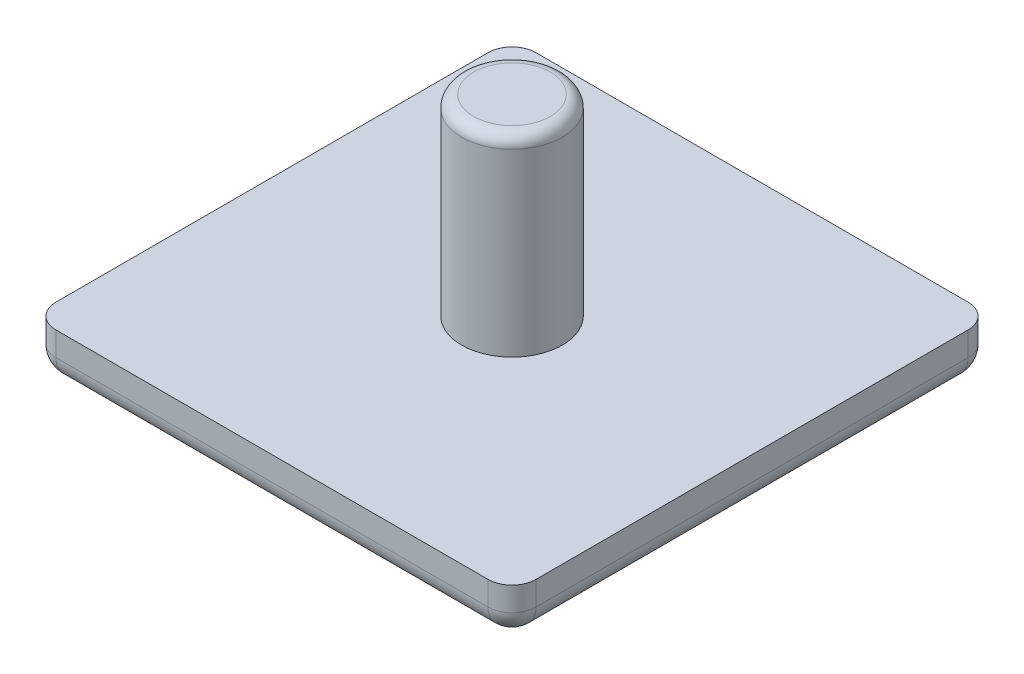
ISO-10303-21;
HEADER;
FILE_DESCRIPTION(('STEP AP214'),'2;1');
FILE_NAME('part.step','',(''),(''),'','','');
FILE_SCHEMA(('AUTOMOTIVE_DESIGN { 1 0 10303 214 1 1 1 1 }'));
ENDSEC;
DATA;
#1=APPLICATION_CONTEXT('core data for automotive mechanical design processes');
#2=APPLICATION_PROTOCOL_DEFINITION('international standard','automotive_design',2000,#1);
#3=PRODUCT_CONTEXT('',#1,'mechanical');
#4=PRODUCT('Part','Part','',(#3));
#5=PRODUCT_RELATED_PRODUCT_CATEGORY('part','',(#4));
#6=PRODUCT_DEFINITION_FORMATION('','',#4);
#7=PRODUCT_DEFINITION_CONTEXT('part definition',#1,'design');
#8=PRODUCT_DEFINITION('design','',#6,#7);
#9=PRODUCT_DEFINITION_SHAPE('','',#8);
#10=(LENGTH_UNIT() NAMED_UNIT(*) SI_UNIT(.MILLI.,.METRE.));
#11=(NAMED_UNIT(*) PLANE_ANGLE_UNIT() SI_UNIT($,.RADIAN.));
#12=(NAMED_UNIT(*) SI_UNIT($,.STERADIAN.) SOLID_ANGLE_UNIT());
#13=UNCERTAINTY_MEASURE_WITH_UNIT(LENGTH_MEASURE(1.E-05),#10,'distance_accuracy_value','');
#14=(GEOMETRIC_REPRESENTATION_CONTEXT(3) GLOBAL_UNCERTAINTY_ASSIGNED_CONTEXT((#13)) GLOBAL_UNIT_ASSIGNED_CONTEXT((#10,
#11,#12)) REPRESENTATION_CONTEXT('',''));
#15=CARTESIAN_POINT('',(0.,0.,0.));
#16=DIRECTION('',(0.,0.,1.));
#17=DIRECTION('',(1.,0.,0.));
#18=AXIS2_PLACEMENT_3D('',#15,#16,#17);
#19=CARTESIAN_POINT('',(10.,8.,-10.));
#20=DIRECTION('',(0.,-1.,0.));
#21=DIRECTION('',(0.,0.,-1.));
#22=AXIS2_PLACEMENT_3D('',#19,#20,#21);
#23=CYLINDRICAL_SURFACE('',#22,2.1);
#24=CARTESIAN_POINT('',(10.,7.5,-10.));
#25=DIRECTION('',(0.,1.,0.));
#26=DIRECTION('',(0.,0.,1.));
#27=AXIS2_PLACEMENT_3D('',#24,#25,#26);
#28=CIRCLE('',#27,2.1);
#29=CARTESIAN_POINT('',(10.,7.5,-7.9));
#30=VERTEX_POINT('',#29);
#31=EDGE_CURVE('E180',#30,#30,#28,.F.);
#32=ORIENTED_EDGE('',*,*,#31,.T.);
#33=EDGE_LOOP('',(#32));
#34=FACE_BOUND('',#33,.T.);
#35=CARTESIAN_POINT('',(10.,0.,-10.));
#36=DIRECTION('',(0.,1.,0.));
#37=DIRECTION('',(0.,0.,1.));
#38=AXIS2_PLACEMENT_3D('',#35,#36,#37);
#39=CIRCLE('',#38,2.1);
#40=CARTESIAN_POINT('',(10.,0.,-7.9));
#41=VERTEX_POINT('',#40);
#42=EDGE_CURVE('E159',#41,#41,#39,.T.);
#43=ORIENTED_EDGE('',*,*,#42,.T.);
#44=EDGE_LOOP('',(#43));
#45=FACE_BOUND('',#44,.T.);
#46=ADVANCED_FACE('F45',(#34,#45),#23,.T.);
#47=CARTESIAN_POINT('',(10.,8.,-10.));
#48=DIRECTION('',(0.,1.,0.));
#49=DIRECTION('',(0.,0.,1.));
#50=AXIS2_PLACEMENT_3D('',#47,#48,#49);
#51=PLANE('',#50);
#52=CARTESIAN_POINT('',(10.,8.,-10.));
#53=DIRECTION('',(0.,1.,0.));
#54=DIRECTION('',(0.,0.,1.));
#55=AXIS2_PLACEMENT_3D('',#52,#53,#54);
#56=CIRCLE('',#55,1.6);
#57=CARTESIAN_POINT('',(10.,8.,-8.4));
#58=VERTEX_POINT('',#57);
#59=EDGE_CURVE('E177',#58,#58,#56,.T.);
#60=ORIENTED_EDGE('',*,*,#59,.T.);
#61=EDGE_LOOP('',(#60));
#62=FACE_BOUND('',#61,.T.);
#63=ADVANCED_FACE('F277',(#62),#51,.T.);
#64=CARTESIAN_POINT('',(0.,-2.,0.));
#65=DIRECTION('',(1.,0.,0.));
#66=DIRECTION('',(0.,0.,-1.));
#67=AXIS2_PLACEMENT_3D('',#64,#65,#66);
#68=PLANE('',#67);
#69=DIRECTION('',(0.,0.,-1.));
#70=VECTOR('',#69,1.);
#71=CARTESIAN_POINT('',(0.,-1.,0.));
#72=LINE('',#71,#70);
#73=CARTESIAN_POINT('',(0.,-1.,-19.));
#74=VERTEX_POINT('',#73);
#75=CARTESIAN_POINT('',(0.,-1.,-1.));
#76=VERTEX_POINT('',#75);
#77=EDGE_CURVE('E175',#74,#76,#72,.F.);
#78=ORIENTED_EDGE('',*,*,#77,.T.);
#79=DIRECTION('',(0.,1.,0.));
#80=VECTOR('',#79,1.);
#81=CARTESIAN_POINT('',(0.,-2.,-1.));
#82=LINE('',#81,#80);
#83=CARTESIAN_POINT('',(0.,0.,-1.));
#84=VERTEX_POINT('',#83);
#85=EDGE_CURVE('E195',#76,#84,#82,.T.);
#86=ORIENTED_EDGE('',*,*,#85,.T.);
#87=DIRECTION('',(0.,0.,-1.));
#88=VECTOR('',#87,1.);
#89=CARTESIAN_POINT('',(0.,0.,0.));
#90=LINE('',#89,#88);
#91=CARTESIAN_POINT('',(0.,0.,-19.));
#92=VERTEX_POINT('',#91);
#93=EDGE_CURVE('E213',#84,#92,#90,.T.);
#94=ORIENTED_EDGE('',*,*,#93,.T.);
#95=DIRECTION('',(0.,1.,0.));
#96=VECTOR('',#95,1.);
#97=CARTESIAN_POINT('',(0.,-2.,-19.));
#98=LINE('',#97,#96);
#99=EDGE_CURVE('E193',#92,#74,#98,.F.);
#100=ORIENTED_EDGE('',*,*,#99,.T.);
#101=EDGE_LOOP('',(#78,#86,#94,#100));
#102=FACE_BOUND('',#101,.T.);
#103=ADVANCED_FACE('F243',(#102),#68,.F.);
#104=CARTESIAN_POINT('',(0.,-2.,-20.));
#105=DIRECTION('',(0.,0.,1.));
#106=DIRECTION('',(1.,0.,0.));
#107=AXIS2_PLACEMENT_3D('',#104,#105,#106);
#108=PLANE('',#107);
#109=DIRECTION('',(1.,0.,0.));
#110=VECTOR('',#109,1.);
#111=CARTESIAN_POINT('',(0.,-1.,-20.));
#112=LINE('',#111,#110);
#113=CARTESIAN_POINT('',(19.,-1.,-20.));
#114=VERTEX_POINT('',#113);
#115=CARTESIAN_POINT('',(1.,-1.,-20.));
#116=VERTEX_POINT('',#115);
#117=EDGE_CURVE('E173',#114,#116,#112,.F.);
#118=ORIENTED_EDGE('',*,*,#117,.T.);
#119=DIRECTION('',(0.,1.,0.));
#120=VECTOR('',#119,1.);
#121=CARTESIAN_POINT('',(1.,-2.,-20.));
#122=LINE('',#121,#120);
#123=CARTESIAN_POINT('',(1.,0.,-20.));
#124=VERTEX_POINT('',#123);
#125=EDGE_CURVE('E69',#116,#124,#122,.T.);
#126=ORIENTED_EDGE('',*,*,#125,.T.);
#127=DIRECTION('',(1.,0.,0.));
#128=VECTOR('',#127,1.);
#129=CARTESIAN_POINT('',(0.,0.,-20.));
#130=LINE('',#129,#128);
#131=CARTESIAN_POINT('',(19.,0.,-20.));
#132=VERTEX_POINT('',#131);
#133=EDGE_CURVE('E247',#124,#132,#130,.T.);
#134=ORIENTED_EDGE('',*,*,#133,.T.);
#135=DIRECTION('',(0.,1.,0.));
#136=VECTOR('',#135,1.);
#137=CARTESIAN_POINT('',(19.,-2.,-20.));
#138=LINE('',#137,#136);
#139=EDGE_CURVE('E208',#132,#114,#138,.F.);
#140=ORIENTED_EDGE('',*,*,#139,.T.);
#141=EDGE_LOOP('',(#118,#126,#134,#140));
#142=FACE_BOUND('',#141,.T.);
#143=ADVANCED_FACE('F268',(#142),#108,.F.);
#144=CARTESIAN_POINT('',(20.,-2.,0.));
#145=DIRECTION('',(-1.,0.,0.));
#146=DIRECTION('',(0.,0.,1.));
#147=AXIS2_PLACEMENT_3D('',#144,#145,#146);
#148=PLANE('',#147);
#149=DIRECTION('',(0.,0.,1.));
#150=VECTOR('',#149,1.);
#151=CARTESIAN_POINT('',(20.,-1.,-20.));
#152=LINE('',#151,#150);
#153=CARTESIAN_POINT('',(20.,-1.,-1.));
#154=VERTEX_POINT('',#153);
#155=CARTESIAN_POINT('',(20.,-1.,-19.));
#156=VERTEX_POINT('',#155);
#157=EDGE_CURVE('E166',#154,#156,#152,.F.);
#158=ORIENTED_EDGE('',*,*,#157,.T.);
#159=DIRECTION('',(0.,1.,0.));
#160=VECTOR('',#159,1.);
#161=CARTESIAN_POINT('',(20.,-2.,-19.));
#162=LINE('',#161,#160);
#163=CARTESIAN_POINT('',(20.,0.,-19.));
#164=VERTEX_POINT('',#163);
#165=EDGE_CURVE('E11',#156,#164,#162,.T.);
#166=ORIENTED_EDGE('',*,*,#165,.T.);
#167=DIRECTION('',(0.,0.,1.));
#168=VECTOR('',#167,1.);
#169=CARTESIAN_POINT('',(20.,0.,0.));
#170=LINE('',#169,#168);
#171=CARTESIAN_POINT('',(20.,0.,-1.));
#172=VERTEX_POINT('',#171);
#173=EDGE_CURVE('E249',#164,#172,#170,.T.);
#174=ORIENTED_EDGE('',*,*,#173,.T.);
#175=DIRECTION('',(0.,1.,0.));
#176=VECTOR('',#175,1.);
#177=CARTESIAN_POINT('',(20.,-2.,-1.));
#178=LINE('',#177,#176);
#179=EDGE_CURVE('E54',#172,#154,#178,.F.);
#180=ORIENTED_EDGE('',*,*,#179,.T.);
#181=EDGE_LOOP('',(#158,#166,#174,#180));
#182=FACE_BOUND('',#181,.T.);
#183=ADVANCED_FACE('F266',(#182),#148,.F.);
#184=CARTESIAN_POINT('',(0.,-2.,0.));
#185=DIRECTION('',(0.,0.,-1.));
#186=DIRECTION('',(-1.,0.,0.));
#187=AXIS2_PLACEMENT_3D('',#184,#185,#186);
#188=PLANE('',#187);
#189=DIRECTION('',(-1.,0.,0.));
#190=VECTOR('',#189,1.);
#191=CARTESIAN_POINT('',(0.,0.,0.));
#192=LINE('',#191,#190);
#193=CARTESIAN_POINT('',(19.,0.,0.));
#194=VERTEX_POINT('',#193);
#195=CARTESIAN_POINT('',(1.,0.,0.));
#196=VERTEX_POINT('',#195);
#197=EDGE_CURVE('E235',#194,#196,#192,.T.);
#198=ORIENTED_EDGE('',*,*,#197,.T.);
#199=DIRECTION('',(0.,1.,0.));
#200=VECTOR('',#199,1.);
#201=CARTESIAN_POINT('',(1.,-2.,0.));
#202=LINE('',#201,#200);
#203=CARTESIAN_POINT('',(1.,-1.,0.));
#204=VERTEX_POINT('',#203);
#205=EDGE_CURVE('E206',#196,#204,#202,.F.);
#206=ORIENTED_EDGE('',*,*,#205,.T.);
#207=DIRECTION('',(-1.,0.,0.));
#208=VECTOR('',#207,1.);
#209=CARTESIAN_POINT('',(20.,-1.,0.));
#210=LINE('',#209,#208);
#211=CARTESIAN_POINT('',(19.,-1.,0.));
#212=VERTEX_POINT('',#211);
#213=EDGE_CURVE('E147',#204,#212,#210,.F.);
#214=ORIENTED_EDGE('',*,*,#213,.T.);
#215=DIRECTION('',(0.,1.,0.));
#216=VECTOR('',#215,1.);
#217=CARTESIAN_POINT('',(19.,-2.,0.));
#218=LINE('',#217,#216);
#219=EDGE_CURVE('E204',#212,#194,#218,.T.);
#220=ORIENTED_EDGE('',*,*,#219,.T.);
#221=EDGE_LOOP('',(#198,#206,#214,#220));
#222=FACE_BOUND('',#221,.T.);
#223=ADVANCED_FACE('F233',(#222),#188,.F.);
#224=CARTESIAN_POINT('',(0.,-2.,0.));
#225=DIRECTION('',(0.,-1.,0.));
#226=DIRECTION('',(0.,0.,-1.));
#227=AXIS2_PLACEMENT_3D('',#224,#225,#226);
#228=PLANE('',#227);
#229=DIRECTION('',(0.,0.,1.));
#230=VECTOR('',#229,1.);
#231=CARTESIAN_POINT('',(19.,-2.,0.));
#232=LINE('',#231,#230);
#233=CARTESIAN_POINT('',(19.,-2.,-19.));
#234=VERTEX_POINT('',#233);
#235=CARTESIAN_POINT('',(19.,-2.,-1.));
#236=VERTEX_POINT('',#235);
#237=EDGE_CURVE('E164',#234,#236,#232,.T.);
#238=ORIENTED_EDGE('',*,*,#237,.T.);
#239=DIRECTION('',(-1.,0.,0.));
#240=VECTOR('',#239,1.);
#241=CARTESIAN_POINT('',(0.,-2.,-1.));
#242=LINE('',#241,#240);
#243=CARTESIAN_POINT('',(1.,-2.,-1.));
#244=VERTEX_POINT('',#243);
#245=EDGE_CURVE('E144',#236,#244,#242,.T.);
#246=ORIENTED_EDGE('',*,*,#245,.T.);
#247=DIRECTION('',(0.,0.,-1.));
#248=VECTOR('',#247,1.);
#249=CARTESIAN_POINT('',(1.,-2.,-20.));
#250=LINE('',#249,#248);
#251=CARTESIAN_POINT('',(1.,-2.,-19.));
#252=VERTEX_POINT('',#251);
#253=EDGE_CURVE('E152',#244,#252,#250,.T.);
#254=ORIENTED_EDGE('',*,*,#253,.T.);
#255=DIRECTION('',(1.,0.,0.));
#256=VECTOR('',#255,1.);
#257=CARTESIAN_POINT('',(20.,-2.,-19.));
#258=LINE('',#257,#256);
#259=EDGE_CURVE('E158',#252,#234,#258,.T.);
#260=ORIENTED_EDGE('',*,*,#259,.T.);
#261=EDGE_LOOP('',(#238,#246,#254,#260));
#262=FACE_BOUND('',#261,.T.);
#263=ADVANCED_FACE('F162',(#262),#228,.T.);
#264=CARTESIAN_POINT('',(0.,0.,0.));
#265=DIRECTION('',(0.,-1.,0.));
#266=DIRECTION('',(0.,0.,-1.));
#267=AXIS2_PLACEMENT_3D('',#264,#265,#266);
#268=PLANE('',#267);
#269=ORIENTED_EDGE('',*,*,#42,.F.);
#270=EDGE_LOOP('',(#269));
#271=FACE_BOUND('',#270,.T.);
#272=ORIENTED_EDGE('',*,*,#93,.F.);
#273=CARTESIAN_POINT('',(1.,0.,-1.));
#274=DIRECTION('',(0.,-1.,0.));
#275=DIRECTION('',(0.,0.,-1.));
#276=AXIS2_PLACEMENT_3D('',#273,#274,#275);
#277=CIRCLE('',#276,1.);
#278=EDGE_CURVE('E202',#84,#196,#277,.F.);
#279=ORIENTED_EDGE('',*,*,#278,.T.);
#280=ORIENTED_EDGE('',*,*,#197,.F.);
#281=CARTESIAN_POINT('',(19.,0.,-1.));
#282=DIRECTION('',(0.,-1.,0.));
#283=DIRECTION('',(0.,0.,-1.));
#284=AXIS2_PLACEMENT_3D('',#281,#282,#283);
#285=CIRCLE('',#284,1.);
#286=EDGE_CURVE('E197',#194,#172,#285,.F.);
#287=ORIENTED_EDGE('',*,*,#286,.T.);
#288=ORIENTED_EDGE('',*,*,#173,.F.);
#289=CARTESIAN_POINT('',(19.,0.,-19.));
#290=DIRECTION('',(0.,-1.,0.));
#291=DIRECTION('',(0.,0.,-1.));
#292=AXIS2_PLACEMENT_3D('',#289,#290,#291);
#293=CIRCLE('',#292,1.);
#294=EDGE_CURVE('E62',#164,#132,#293,.F.);
#295=ORIENTED_EDGE('',*,*,#294,.T.);
#296=ORIENTED_EDGE('',*,*,#133,.F.);
#297=CARTESIAN_POINT('',(1.,0.,-19.));
#298=DIRECTION('',(0.,-1.,0.));
#299=DIRECTION('',(0.,0.,-1.));
#300=AXIS2_PLACEMENT_3D('',#297,#298,#299);
#301=CIRCLE('',#300,1.);
#302=EDGE_CURVE('E200',#124,#92,#301,.F.);
#303=ORIENTED_EDGE('',*,*,#302,.T.);
#304=EDGE_LOOP('',(#272,#279,#280,#287,#288,#295,#296,#303));
#305=FACE_BOUND('',#304,.T.);
#306=ADVANCED_FACE('F245',(#271,#305),#268,.F.);
#307=CARTESIAN_POINT('',(0.,-1.,-19.));
#308=DIRECTION('',(-1.,0.,0.));
#309=DIRECTION('',(0.,0.,1.));
#310=AXIS2_PLACEMENT_3D('',#307,#308,#309);
#311=CYLINDRICAL_SURFACE('',#310,1.);
#312=ORIENTED_EDGE('',*,*,#259,.F.);
#313=CARTESIAN_POINT('',(1.,-1.,-19.));
#314=DIRECTION('',(-1.,0.,0.));
#315=DIRECTION('',(0.,0.,1.));
#316=AXIS2_PLACEMENT_3D('',#313,#314,#315);
#317=CIRCLE('',#316,1.);
#318=EDGE_CURVE('E186',#252,#116,#317,.F.);
#319=ORIENTED_EDGE('',*,*,#318,.T.);
#320=ORIENTED_EDGE('',*,*,#117,.F.);
#321=CARTESIAN_POINT('',(19.,-1.,-19.));
#322=DIRECTION('',(-1.,0.,0.));
#323=DIRECTION('',(0.,0.,1.));
#324=AXIS2_PLACEMENT_3D('',#321,#322,#323);
#325=CIRCLE('',#324,1.);
#326=EDGE_CURVE('E135',#114,#234,#325,.T.);
#327=ORIENTED_EDGE('',*,*,#326,.T.);
#328=EDGE_LOOP('',(#312,#319,#320,#327));
#329=FACE_BOUND('',#328,.T.);
#330=ADVANCED_FACE('F295',(#329),#311,.T.);
#331=CARTESIAN_POINT('',(19.,-1.,0.));
#332=DIRECTION('',(0.,0.,-1.));
#333=DIRECTION('',(-1.,0.,0.));
#334=AXIS2_PLACEMENT_3D('',#331,#332,#333);
#335=CYLINDRICAL_SURFACE('',#334,1.);
#336=ORIENTED_EDGE('',*,*,#237,.F.);
#337=CARTESIAN_POINT('',(19.,-1.,-19.));
#338=DIRECTION('',(0.,0.,-1.));
#339=DIRECTION('',(-1.,0.,0.));
#340=AXIS2_PLACEMENT_3D('',#337,#338,#339);
#341=CIRCLE('',#340,1.);
#342=EDGE_CURVE('E190',#234,#156,#341,.F.);
#343=ORIENTED_EDGE('',*,*,#342,.T.);
#344=ORIENTED_EDGE('',*,*,#157,.F.);
#345=CARTESIAN_POINT('',(19.,-1.,-1.));
#346=DIRECTION('',(0.,0.,-1.));
#347=DIRECTION('',(-1.,0.,0.));
#348=AXIS2_PLACEMENT_3D('',#345,#346,#347);
#349=CIRCLE('',#348,1.);
#350=EDGE_CURVE('E188',#154,#236,#349,.T.);
#351=ORIENTED_EDGE('',*,*,#350,.T.);
#352=EDGE_LOOP('',(#336,#343,#344,#351));
#353=FACE_BOUND('',#352,.T.);
#354=ADVANCED_FACE('F258',(#353),#335,.T.);
#355=CARTESIAN_POINT('',(1.,-1.,0.));
#356=DIRECTION('',(0.,0.,1.));
#357=DIRECTION('',(1.,0.,0.));
#358=AXIS2_PLACEMENT_3D('',#355,#356,#357);
#359=CYLINDRICAL_SURFACE('',#358,1.);
#360=ORIENTED_EDGE('',*,*,#253,.F.);
#361=CARTESIAN_POINT('',(1.,-1.,-1.));
#362=DIRECTION('',(0.,0.,1.));
#363=DIRECTION('',(1.,0.,0.));
#364=AXIS2_PLACEMENT_3D('',#361,#362,#363);
#365=CIRCLE('',#364,1.);
#366=EDGE_CURVE('E125',#244,#76,#365,.F.);
#367=ORIENTED_EDGE('',*,*,#366,.T.);
#368=ORIENTED_EDGE('',*,*,#77,.F.);
#369=CARTESIAN_POINT('',(1.,-1.,-19.));
#370=DIRECTION('',(0.,0.,1.));
#371=DIRECTION('',(1.,0.,0.));
#372=AXIS2_PLACEMENT_3D('',#369,#370,#371);
#373=CIRCLE('',#372,1.);
#374=EDGE_CURVE('E136',#74,#252,#373,.T.);
#375=ORIENTED_EDGE('',*,*,#374,.T.);
#376=EDGE_LOOP('',(#360,#367,#368,#375));
#377=FACE_BOUND('',#376,.T.);
#378=ADVANCED_FACE('F153',(#377),#359,.T.);
#379=CARTESIAN_POINT('',(0.,-1.,-1.));
#380=DIRECTION('',(1.,0.,0.));
#381=DIRECTION('',(0.,0.,-1.));
#382=AXIS2_PLACEMENT_3D('',#379,#380,#381);
#383=CYLINDRICAL_SURFACE('',#382,1.);
#384=ORIENTED_EDGE('',*,*,#213,.F.);
#385=CARTESIAN_POINT('',(1.,-1.,-1.));
#386=DIRECTION('',(1.,0.,0.));
#387=DIRECTION('',(0.,0.,-1.));
#388=AXIS2_PLACEMENT_3D('',#385,#386,#387);
#389=CIRCLE('',#388,1.);
#390=EDGE_CURVE('E128',#204,#244,#389,.T.);
#391=ORIENTED_EDGE('',*,*,#390,.T.);
#392=ORIENTED_EDGE('',*,*,#245,.F.);
#393=CARTESIAN_POINT('',(19.,-1.,-1.));
#394=DIRECTION('',(1.,0.,0.));
#395=DIRECTION('',(0.,0.,-1.));
#396=AXIS2_PLACEMENT_3D('',#393,#394,#395);
#397=CIRCLE('',#396,1.);
#398=EDGE_CURVE('E148',#236,#212,#397,.F.);
#399=ORIENTED_EDGE('',*,*,#398,.T.);
#400=EDGE_LOOP('',(#384,#391,#392,#399));
#401=FACE_BOUND('',#400,.T.);
#402=ADVANCED_FACE('F141',(#401),#383,.T.);
#403=CARTESIAN_POINT('',(10.,7.5,-10.));
#404=DIRECTION('',(0.,1.,0.));
#405=DIRECTION('',(0.,0.,1.));
#406=AXIS2_PLACEMENT_3D('',#403,#404,#405);
#407=TOROIDAL_SURFACE('',#406,1.6,0.5);
#408=ORIENTED_EDGE('',*,*,#31,.F.);
#409=EDGE_LOOP('',(#408));
#410=FACE_BOUND('',#409,.T.);
#411=ORIENTED_EDGE('',*,*,#59,.F.);
#412=EDGE_LOOP('',(#411));
#413=FACE_BOUND('',#412,.T.);
#414=ADVANCED_FACE('F290',(#410,#413),#407,.T.);
#415=CARTESIAN_POINT('',(1.,-2.,-1.));
#416=DIRECTION('',(0.,1.,0.));
#417=DIRECTION('',(0.,0.,1.));
#418=AXIS2_PLACEMENT_3D('',#415,#416,#417);
#419=CYLINDRICAL_SURFACE('',#418,1.);
#420=ORIENTED_EDGE('',*,*,#278,.F.);
#421=ORIENTED_EDGE('',*,*,#85,.F.);
#422=CARTESIAN_POINT('',(1.,-1.,-1.));
#423=DIRECTION('',(0.,-1.,0.));
#424=DIRECTION('',(0.,0.,-1.));
#425=AXIS2_PLACEMENT_3D('',#422,#423,#424);
#426=CIRCLE('',#425,1.);
#427=EDGE_CURVE('E130',#204,#76,#426,.T.);
#428=ORIENTED_EDGE('',*,*,#427,.F.);
#429=ORIENTED_EDGE('',*,*,#205,.F.);
#430=EDGE_LOOP('',(#420,#421,#428,#429));
#431=FACE_BOUND('',#430,.T.);
#432=ADVANCED_FACE('F238',(#431),#419,.T.);
#433=CARTESIAN_POINT('',(1.,-1.,-1.));
#434=DIRECTION('',(0.,0.,1.));
#435=DIRECTION('',(1.,0.,0.));
#436=AXIS2_PLACEMENT_3D('',#433,#434,#435);
#437=SPHERICAL_SURFACE('',#436,1.);
#438=ORIENTED_EDGE('',*,*,#427,.T.);
#439=ORIENTED_EDGE('',*,*,#366,.F.);
#440=ORIENTED_EDGE('',*,*,#390,.F.);
#441=EDGE_LOOP('',(#438,#439,#440));
#442=FACE_BOUND('',#441,.T.);
#443=ADVANCED_FACE('F127',(#442),#437,.T.);
#444=CARTESIAN_POINT('',(1.,-2.,-19.));
#445=DIRECTION('',(0.,1.,0.));
#446=DIRECTION('',(0.,0.,1.));
#447=AXIS2_PLACEMENT_3D('',#444,#445,#446);
#448=CYLINDRICAL_SURFACE('',#447,1.);
#449=ORIENTED_EDGE('',*,*,#302,.F.);
#450=ORIENTED_EDGE('',*,*,#125,.F.);
#451=CARTESIAN_POINT('',(1.,-1.,-19.));
#452=DIRECTION('',(0.,-1.,0.));
#453=DIRECTION('',(0.,0.,-1.));
#454=AXIS2_PLACEMENT_3D('',#451,#452,#453);
#455=CIRCLE('',#454,1.);
#456=EDGE_CURVE('E214',#74,#116,#455,.T.);
#457=ORIENTED_EDGE('',*,*,#456,.F.);
#458=ORIENTED_EDGE('',*,*,#99,.F.);
#459=EDGE_LOOP('',(#449,#450,#457,#458));
#460=FACE_BOUND('',#459,.T.);
#461=ADVANCED_FACE('F303',(#460),#448,.T.);
#462=CARTESIAN_POINT('',(1.,-1.,-19.));
#463=DIRECTION('',(0.,0.,1.));
#464=DIRECTION('',(1.,0.,0.));
#465=AXIS2_PLACEMENT_3D('',#462,#463,#464);
#466=SPHERICAL_SURFACE('',#465,1.);
#467=ORIENTED_EDGE('',*,*,#456,.T.);
#468=ORIENTED_EDGE('',*,*,#318,.F.);
#469=ORIENTED_EDGE('',*,*,#374,.F.);
#470=EDGE_LOOP('',(#467,#468,#469));
#471=FACE_BOUND('',#470,.T.);
#472=ADVANCED_FACE('F306',(#471),#466,.T.);
#473=CARTESIAN_POINT('',(19.,-2.,-19.));
#474=DIRECTION('',(0.,1.,0.));
#475=DIRECTION('',(0.,0.,1.));
#476=AXIS2_PLACEMENT_3D('',#473,#474,#475);
#477=CYLINDRICAL_SURFACE('',#476,1.);
#478=ORIENTED_EDGE('',*,*,#294,.F.);
#479=ORIENTED_EDGE('',*,*,#165,.F.);
#480=CARTESIAN_POINT('',(19.,-1.,-19.));
#481=DIRECTION('',(0.,-1.,0.));
#482=DIRECTION('',(0.,0.,-1.));
#483=AXIS2_PLACEMENT_3D('',#480,#481,#482);
#484=CIRCLE('',#483,1.);
#485=EDGE_CURVE('E216',#114,#156,#484,.T.);
#486=ORIENTED_EDGE('',*,*,#485,.F.);
#487=ORIENTED_EDGE('',*,*,#139,.F.);
#488=EDGE_LOOP('',(#478,#479,#486,#487));
#489=FACE_BOUND('',#488,.T.);
#490=ADVANCED_FACE('F264',(#489),#477,.T.);
#491=CARTESIAN_POINT('',(19.,-1.,-19.));
#492=DIRECTION('',(0.,0.,1.));
#493=DIRECTION('',(1.,0.,0.));
#494=AXIS2_PLACEMENT_3D('',#491,#492,#493);
#495=SPHERICAL_SURFACE('',#494,1.);
#496=ORIENTED_EDGE('',*,*,#342,.F.);
#497=ORIENTED_EDGE('',*,*,#326,.F.);
#498=ORIENTED_EDGE('',*,*,#485,.T.);
#499=EDGE_LOOP('',(#496,#497,#498));
#500=FACE_BOUND('',#499,.T.);
#501=ADVANCED_FACE('F260',(#500),#495,.T.);
#502=CARTESIAN_POINT('',(19.,-2.,-1.));
#503=DIRECTION('',(0.,1.,0.));
#504=DIRECTION('',(0.,0.,1.));
#505=AXIS2_PLACEMENT_3D('',#502,#503,#504);
#506=CYLINDRICAL_SURFACE('',#505,1.);
#507=ORIENTED_EDGE('',*,*,#286,.F.);
#508=ORIENTED_EDGE('',*,*,#219,.F.);
#509=CARTESIAN_POINT('',(19.,-1.,-1.));
#510=DIRECTION('',(0.,-1.,0.));
#511=DIRECTION('',(0.,0.,-1.));
#512=AXIS2_PLACEMENT_3D('',#509,#510,#511);
#513=CIRCLE('',#512,1.);
#514=EDGE_CURVE('E49',#154,#212,#513,.T.);
#515=ORIENTED_EDGE('',*,*,#514,.F.);
#516=ORIENTED_EDGE('',*,*,#179,.F.);
#517=EDGE_LOOP('',(#507,#508,#515,#516));
#518=FACE_BOUND('',#517,.T.);
#519=ADVANCED_FACE('F47',(#518),#506,.T.);
#520=CARTESIAN_POINT('',(19.,-1.,-1.));
#521=DIRECTION('',(0.,0.,1.));
#522=DIRECTION('',(1.,0.,0.));
#523=AXIS2_PLACEMENT_3D('',#520,#521,#522);
#524=SPHERICAL_SURFACE('',#523,1.);
#525=ORIENTED_EDGE('',*,*,#398,.F.);
#526=ORIENTED_EDGE('',*,*,#350,.F.);
#527=ORIENTED_EDGE('',*,*,#514,.T.);
#528=EDGE_LOOP('',(#525,#526,#527));
#529=FACE_BOUND('',#528,.T.);
#530=ADVANCED_FACE('F226',(#529),#524,.T.);
#531=CLOSED_SHELL('',(#46,#63,#103,#143,#183,#223,#263,#306,#330,#354,#378,#402,#414,#432,#443,
#461,#472,#490,#501,#519,#530));
#532=MANIFOLD_SOLID_BREP('B2',#531);
#533=ADVANCED_BREP_SHAPE_REPRESENTATION('',(#18,#532),#14);
#534=SHAPE_DEFINITION_REPRESENTATION(#9,#533);
ENDSEC;
END-ISO-10303-21;
